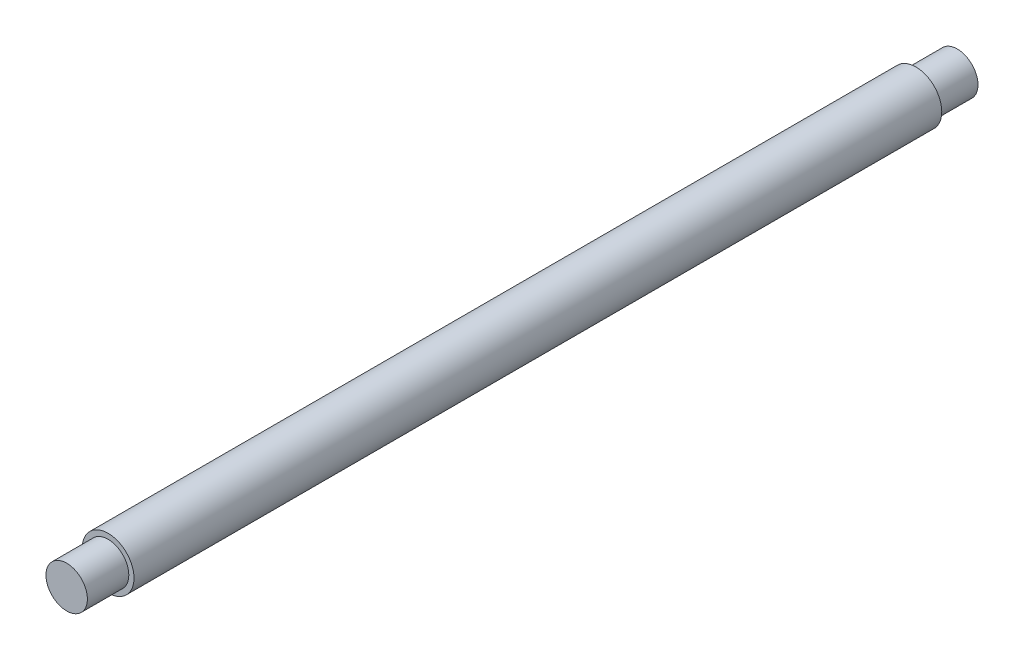
ISO-10303-21;
HEADER;
FILE_DESCRIPTION(('STEP AP214'),'2;1');
FILE_NAME('part.step','',(''),(''),'','','');
FILE_SCHEMA(('AUTOMOTIVE_DESIGN { 1 0 10303 214 1 1 1 1 }'));
ENDSEC;
DATA;
#1=APPLICATION_CONTEXT('core data for automotive mechanical design processes');
#2=APPLICATION_PROTOCOL_DEFINITION('international standard','automotive_design',2000,#1);
#3=PRODUCT_CONTEXT('',#1,'mechanical');
#4=PRODUCT('Part','Part','',(#3));
#5=PRODUCT_RELATED_PRODUCT_CATEGORY('part','',(#4));
#6=PRODUCT_DEFINITION_FORMATION('','',#4);
#7=PRODUCT_DEFINITION_CONTEXT('part definition',#1,'design');
#8=PRODUCT_DEFINITION('design','',#6,#7);
#9=PRODUCT_DEFINITION_SHAPE('','',#8);
#10=(LENGTH_UNIT() NAMED_UNIT(*) SI_UNIT(.MILLI.,.METRE.));
#11=(NAMED_UNIT(*) PLANE_ANGLE_UNIT() SI_UNIT($,.RADIAN.));
#12=(NAMED_UNIT(*) SI_UNIT($,.STERADIAN.) SOLID_ANGLE_UNIT());
#13=UNCERTAINTY_MEASURE_WITH_UNIT(LENGTH_MEASURE(1.E-05),#10,'distance_accuracy_value','');
#14=(GEOMETRIC_REPRESENTATION_CONTEXT(3) GLOBAL_UNCERTAINTY_ASSIGNED_CONTEXT((#13)) GLOBAL_UNIT_ASSIGNED_CONTEXT((#10,
#11,#12)) REPRESENTATION_CONTEXT('',''));
#15=CARTESIAN_POINT('',(0.,0.,0.));
#16=DIRECTION('',(0.,0.,1.));
#17=DIRECTION('',(1.,0.,0.));
#18=AXIS2_PLACEMENT_3D('',#15,#16,#17);
#19=CARTESIAN_POINT('',(0.,0.,78.));
#20=DIRECTION('',(0.,0.,-1.));
#21=DIRECTION('',(-1.,0.,0.));
#22=AXIS2_PLACEMENT_3D('',#19,#20,#21);
#23=CYLINDRICAL_SURFACE('',#22,5.);
#24=CARTESIAN_POINT('',(0.,0.,78.));
#25=DIRECTION('',(0.,0.,1.));
#26=DIRECTION('',(1.,0.,0.));
#27=AXIS2_PLACEMENT_3D('',#24,#25,#26);
#28=CIRCLE('',#27,5.);
#29=CARTESIAN_POINT('',(5.,0.,78.));
#30=VERTEX_POINT('',#29);
#31=EDGE_CURVE('E51',#30,#30,#28,.T.);
#32=ORIENTED_EDGE('',*,*,#31,.F.);
#33=EDGE_LOOP('',(#32));
#34=FACE_BOUND('',#33,.T.);
#35=CARTESIAN_POINT('',(0.,0.,-78.));
#36=DIRECTION('',(0.,0.,1.));
#37=DIRECTION('',(1.,0.,0.));
#38=AXIS2_PLACEMENT_3D('',#35,#36,#37);
#39=CIRCLE('',#38,5.);
#40=CARTESIAN_POINT('',(5.,0.,-78.));
#41=VERTEX_POINT('',#40);
#42=EDGE_CURVE('E46',#41,#41,#39,.T.);
#43=ORIENTED_EDGE('',*,*,#42,.T.);
#44=EDGE_LOOP('',(#43));
#45=FACE_BOUND('',#44,.T.);
#46=ADVANCED_FACE('F43',(#34,#45),#23,.T.);
#47=CARTESIAN_POINT('',(0.,0.,78.));
#48=DIRECTION('',(0.,0.,1.));
#49=DIRECTION('',(1.,0.,0.));
#50=AXIS2_PLACEMENT_3D('',#47,#48,#49);
#51=PLANE('',#50);
#52=CARTESIAN_POINT('',(0.,0.,78.));
#53=DIRECTION('',(0.,0.,1.));
#54=DIRECTION('',(1.,0.,0.));
#55=AXIS2_PLACEMENT_3D('',#52,#53,#54);
#56=CIRCLE('',#55,4.);
#57=CARTESIAN_POINT('',(4.,0.,78.));
#58=VERTEX_POINT('',#57);
#59=EDGE_CURVE('E10',#58,#58,#56,.T.);
#60=ORIENTED_EDGE('',*,*,#59,.F.);
#61=EDGE_LOOP('',(#60));
#62=FACE_BOUND('',#61,.T.);
#63=ORIENTED_EDGE('',*,*,#31,.T.);
#64=EDGE_LOOP('',(#63));
#65=FACE_BOUND('',#64,.T.);
#66=ADVANCED_FACE('F83',(#62,#65),#51,.T.);
#67=CARTESIAN_POINT('',(0.,0.,-78.));
#68=DIRECTION('',(0.,0.,1.));
#69=DIRECTION('',(1.,0.,0.));
#70=AXIS2_PLACEMENT_3D('',#67,#68,#69);
#71=PLANE('',#70);
#72=CARTESIAN_POINT('',(0.,0.,-78.));
#73=DIRECTION('',(0.,0.,1.));
#74=DIRECTION('',(1.,0.,0.));
#75=AXIS2_PLACEMENT_3D('',#72,#73,#74);
#76=CIRCLE('',#75,4.);
#77=CARTESIAN_POINT('',(4.,0.,-78.));
#78=VERTEX_POINT('',#77);
#79=EDGE_CURVE('E65',#78,#78,#76,.T.);
#80=ORIENTED_EDGE('',*,*,#79,.T.);
#81=EDGE_LOOP('',(#80));
#82=FACE_BOUND('',#81,.T.);
#83=ORIENTED_EDGE('',*,*,#42,.F.);
#84=EDGE_LOOP('',(#83));
#85=FACE_BOUND('',#84,.T.);
#86=ADVANCED_FACE('F87',(#82,#85),#71,.F.);
#87=CARTESIAN_POINT('',(0.,0.,86.));
#88=DIRECTION('',(0.,0.,-1.));
#89=DIRECTION('',(-1.,0.,0.));
#90=AXIS2_PLACEMENT_3D('',#87,#88,#89);
#91=CYLINDRICAL_SURFACE('',#90,4.);
#92=CARTESIAN_POINT('',(0.,0.,86.));
#93=DIRECTION('',(0.,0.,1.));
#94=DIRECTION('',(1.,0.,0.));
#95=AXIS2_PLACEMENT_3D('',#92,#93,#94);
#96=CIRCLE('',#95,4.);
#97=CARTESIAN_POINT('',(4.,0.,86.));
#98=VERTEX_POINT('',#97);
#99=EDGE_CURVE('E60',#98,#98,#96,.T.);
#100=ORIENTED_EDGE('',*,*,#99,.F.);
#101=EDGE_LOOP('',(#100));
#102=FACE_BOUND('',#101,.T.);
#103=ORIENTED_EDGE('',*,*,#59,.T.);
#104=EDGE_LOOP('',(#103));
#105=FACE_BOUND('',#104,.T.);
#106=ADVANCED_FACE('F96',(#102,#105),#91,.T.);
#107=CARTESIAN_POINT('',(0.,0.,86.));
#108=DIRECTION('',(0.,0.,1.));
#109=DIRECTION('',(1.,0.,0.));
#110=AXIS2_PLACEMENT_3D('',#107,#108,#109);
#111=PLANE('',#110);
#112=ORIENTED_EDGE('',*,*,#99,.T.);
#113=EDGE_LOOP('',(#112));
#114=FACE_BOUND('',#113,.T.);
#115=ADVANCED_FACE('F80',(#114),#111,.T.);
#116=CARTESIAN_POINT('',(0.,0.,-86.));
#117=DIRECTION('',(0.,0.,1.));
#118=DIRECTION('',(1.,0.,0.));
#119=AXIS2_PLACEMENT_3D('',#116,#117,#118);
#120=CYLINDRICAL_SURFACE('',#119,4.);
#121=CARTESIAN_POINT('',(0.,0.,-86.));
#122=DIRECTION('',(0.,0.,1.));
#123=DIRECTION('',(1.,0.,0.));
#124=AXIS2_PLACEMENT_3D('',#121,#122,#123);
#125=CIRCLE('',#124,4.);
#126=CARTESIAN_POINT('',(4.,0.,-86.));
#127=VERTEX_POINT('',#126);
#128=EDGE_CURVE('E64',#127,#127,#125,.T.);
#129=ORIENTED_EDGE('',*,*,#128,.T.);
#130=EDGE_LOOP('',(#129));
#131=FACE_BOUND('',#130,.T.);
#132=ORIENTED_EDGE('',*,*,#79,.F.);
#133=EDGE_LOOP('',(#132));
#134=FACE_BOUND('',#133,.T.);
#135=ADVANCED_FACE('F72',(#131,#134),#120,.T.);
#136=CARTESIAN_POINT('',(0.,0.,-86.));
#137=DIRECTION('',(0.,0.,-1.));
#138=DIRECTION('',(1.,0.,0.));
#139=AXIS2_PLACEMENT_3D('',#136,#137,#138);
#140=PLANE('',#139);
#141=ORIENTED_EDGE('',*,*,#128,.F.);
#142=EDGE_LOOP('',(#141));
#143=FACE_BOUND('',#142,.T.);
#144=ADVANCED_FACE('F75',(#143),#140,.T.);
#145=CLOSED_SHELL('',(#46,#66,#86,#106,#115,#135,#144));
#146=MANIFOLD_SOLID_BREP('B2',#145);
#147=ADVANCED_BREP_SHAPE_REPRESENTATION('',(#18,#146),#14);
#148=SHAPE_DEFINITION_REPRESENTATION(#9,#147);
ENDSEC;
END-ISO-10303-21;
